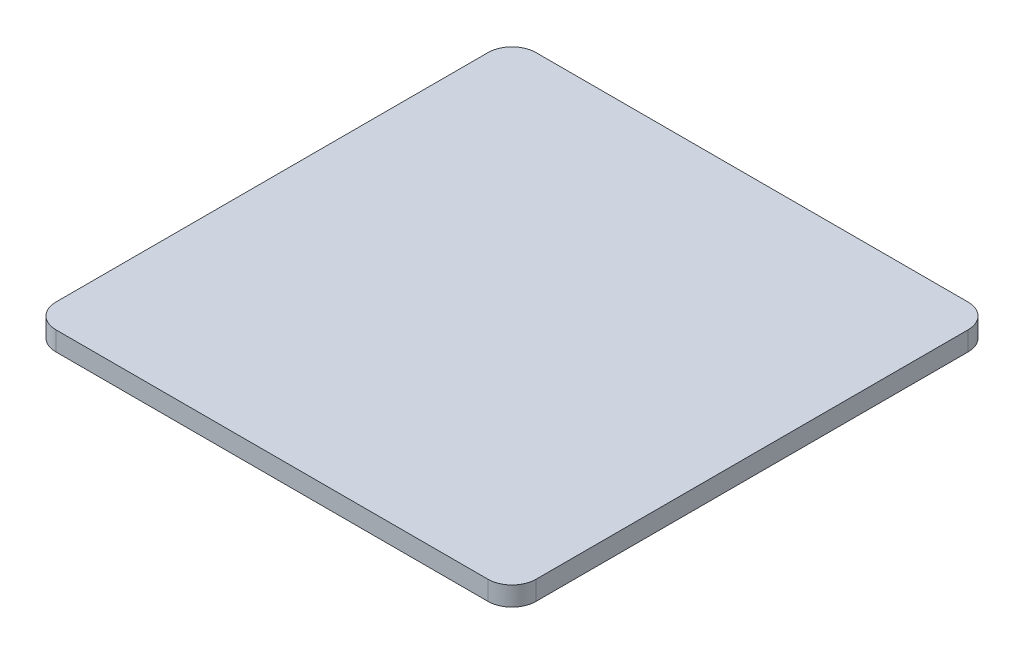
ISO-10303-21;
HEADER;
FILE_DESCRIPTION(('STEP AP214'),'2;1');
FILE_NAME('part.step','',(''),(''),'','','');
FILE_SCHEMA(('AUTOMOTIVE_DESIGN { 1 0 10303 214 1 1 1 1 }'));
ENDSEC;
DATA;
#1=APPLICATION_CONTEXT('core data for automotive mechanical design processes');
#2=APPLICATION_PROTOCOL_DEFINITION('international standard','automotive_design',2000,#1);
#3=PRODUCT_CONTEXT('',#1,'mechanical');
#4=PRODUCT('Part','Part','',(#3));
#5=PRODUCT_RELATED_PRODUCT_CATEGORY('part','',(#4));
#6=PRODUCT_DEFINITION_FORMATION('','',#4);
#7=PRODUCT_DEFINITION_CONTEXT('part definition',#1,'design');
#8=PRODUCT_DEFINITION('design','',#6,#7);
#9=PRODUCT_DEFINITION_SHAPE('','',#8);
#10=(LENGTH_UNIT() NAMED_UNIT(*) SI_UNIT(.MILLI.,.METRE.));
#11=(NAMED_UNIT(*) PLANE_ANGLE_UNIT() SI_UNIT($,.RADIAN.));
#12=(NAMED_UNIT(*) SI_UNIT($,.STERADIAN.) SOLID_ANGLE_UNIT());
#13=UNCERTAINTY_MEASURE_WITH_UNIT(LENGTH_MEASURE(1.E-05),#10,'distance_accuracy_value','');
#14=(GEOMETRIC_REPRESENTATION_CONTEXT(3) GLOBAL_UNCERTAINTY_ASSIGNED_CONTEXT((#13)) GLOBAL_UNIT_ASSIGNED_CONTEXT((#10,
#11,#12)) REPRESENTATION_CONTEXT('',''));
#15=CARTESIAN_POINT('',(0.,0.,0.));
#16=DIRECTION('',(0.,0.,1.));
#17=DIRECTION('',(1.,0.,0.));
#18=AXIS2_PLACEMENT_3D('',#15,#16,#17);
#19=CARTESIAN_POINT('',(50.,4.,-50.));
#20=DIRECTION('',(-1.,0.,0.));
#21=DIRECTION('',(0.,0.,1.));
#22=AXIS2_PLACEMENT_3D('',#19,#20,#21);
#23=PLANE('',#22);
#24=DIRECTION('',(0.,0.,-1.));
#25=VECTOR('',#24,1.);
#26=CARTESIAN_POINT('',(50.,4.,-50.));
#27=LINE('',#26,#25);
#28=CARTESIAN_POINT('',(50.,4.,45.));
#29=VERTEX_POINT('',#28);
#30=CARTESIAN_POINT('',(50.,4.,-45.));
#31=VERTEX_POINT('',#30);
#32=EDGE_CURVE('E126',#29,#31,#27,.T.);
#33=ORIENTED_EDGE('',*,*,#32,.F.);
#34=DIRECTION('',(0.,-1.,0.));
#35=VECTOR('',#34,1.);
#36=CARTESIAN_POINT('',(50.,4.,45.));
#37=LINE('',#36,#35);
#38=CARTESIAN_POINT('',(50.,0.,45.));
#39=VERTEX_POINT('',#38);
#40=EDGE_CURVE('E110',#29,#39,#37,.T.);
#41=ORIENTED_EDGE('',*,*,#40,.T.);
#42=DIRECTION('',(0.,0.,-1.));
#43=VECTOR('',#42,1.);
#44=CARTESIAN_POINT('',(50.,0.,-50.));
#45=LINE('',#44,#43);
#46=CARTESIAN_POINT('',(50.,0.,-45.));
#47=VERTEX_POINT('',#46);
#48=EDGE_CURVE('E123',#39,#47,#45,.T.);
#49=ORIENTED_EDGE('',*,*,#48,.T.);
#50=DIRECTION('',(0.,-1.,0.));
#51=VECTOR('',#50,1.);
#52=CARTESIAN_POINT('',(50.,4.,-45.));
#53=LINE('',#52,#51);
#54=EDGE_CURVE('E129',#47,#31,#53,.F.);
#55=ORIENTED_EDGE('',*,*,#54,.T.);
#56=EDGE_LOOP('',(#33,#41,#49,#55));
#57=FACE_BOUND('',#56,.T.);
#58=ADVANCED_FACE('F39',(#57),#23,.F.);
#59=CARTESIAN_POINT('',(-50.,4.,-50.));
#60=DIRECTION('',(0.,0.,1.));
#61=DIRECTION('',(1.,0.,0.));
#62=AXIS2_PLACEMENT_3D('',#59,#60,#61);
#63=PLANE('',#62);
#64=DIRECTION('',(-1.,0.,0.));
#65=VECTOR('',#64,1.);
#66=CARTESIAN_POINT('',(-50.,0.,-50.));
#67=LINE('',#66,#65);
#68=CARTESIAN_POINT('',(45.,0.,-50.));
#69=VERTEX_POINT('',#68);
#70=CARTESIAN_POINT('',(-45.,0.,-50.));
#71=VERTEX_POINT('',#70);
#72=EDGE_CURVE('E135',#69,#71,#67,.T.);
#73=ORIENTED_EDGE('',*,*,#72,.T.);
#74=DIRECTION('',(0.,-1.,0.));
#75=VECTOR('',#74,1.);
#76=CARTESIAN_POINT('',(-45.,4.,-50.));
#77=LINE('',#76,#75);
#78=CARTESIAN_POINT('',(-45.,4.,-50.));
#79=VERTEX_POINT('',#78);
#80=EDGE_CURVE('E11',#71,#79,#77,.F.);
#81=ORIENTED_EDGE('',*,*,#80,.T.);
#82=DIRECTION('',(-1.,0.,0.));
#83=VECTOR('',#82,1.);
#84=CARTESIAN_POINT('',(-50.,4.,-50.));
#85=LINE('',#84,#83);
#86=CARTESIAN_POINT('',(45.,4.,-50.));
#87=VERTEX_POINT('',#86);
#88=EDGE_CURVE('E186',#87,#79,#85,.T.);
#89=ORIENTED_EDGE('',*,*,#88,.F.);
#90=DIRECTION('',(0.,-1.,0.));
#91=VECTOR('',#90,1.);
#92=CARTESIAN_POINT('',(45.,4.,-50.));
#93=LINE('',#92,#91);
#94=EDGE_CURVE('E48',#87,#69,#93,.T.);
#95=ORIENTED_EDGE('',*,*,#94,.T.);
#96=EDGE_LOOP('',(#73,#81,#89,#95));
#97=FACE_BOUND('',#96,.T.);
#98=ADVANCED_FACE('F184',(#97),#63,.F.);
#99=CARTESIAN_POINT('',(-50.,4.,-50.));
#100=DIRECTION('',(1.,0.,0.));
#101=DIRECTION('',(0.,0.,-1.));
#102=AXIS2_PLACEMENT_3D('',#99,#100,#101);
#103=PLANE('',#102);
#104=DIRECTION('',(0.,0.,1.));
#105=VECTOR('',#104,1.);
#106=CARTESIAN_POINT('',(-50.,4.,-50.));
#107=LINE('',#106,#105);
#108=CARTESIAN_POINT('',(-50.,4.,-45.));
#109=VERTEX_POINT('',#108);
#110=CARTESIAN_POINT('',(-50.,4.,45.));
#111=VERTEX_POINT('',#110);
#112=EDGE_CURVE('E194',#109,#111,#107,.T.);
#113=ORIENTED_EDGE('',*,*,#112,.F.);
#114=DIRECTION('',(0.,-1.,0.));
#115=VECTOR('',#114,1.);
#116=CARTESIAN_POINT('',(-50.,4.,-45.));
#117=LINE('',#116,#115);
#118=CARTESIAN_POINT('',(-50.,0.,-45.));
#119=VERTEX_POINT('',#118);
#120=EDGE_CURVE('E176',#109,#119,#117,.T.);
#121=ORIENTED_EDGE('',*,*,#120,.T.);
#122=DIRECTION('',(0.,0.,1.));
#123=VECTOR('',#122,1.);
#124=CARTESIAN_POINT('',(-50.,0.,-50.));
#125=LINE('',#124,#123);
#126=CARTESIAN_POINT('',(-50.,0.,45.));
#127=VERTEX_POINT('',#126);
#128=EDGE_CURVE('E139',#119,#127,#125,.T.);
#129=ORIENTED_EDGE('',*,*,#128,.T.);
#130=DIRECTION('',(0.,-1.,0.));
#131=VECTOR('',#130,1.);
#132=CARTESIAN_POINT('',(-50.,4.,45.));
#133=LINE('',#132,#131);
#134=EDGE_CURVE('E55',#127,#111,#133,.F.);
#135=ORIENTED_EDGE('',*,*,#134,.T.);
#136=EDGE_LOOP('',(#113,#121,#129,#135));
#137=FACE_BOUND('',#136,.T.);
#138=ADVANCED_FACE('F193',(#137),#103,.F.);
#139=CARTESIAN_POINT('',(-50.,4.,50.));
#140=DIRECTION('',(0.,0.,-1.));
#141=DIRECTION('',(-1.,0.,0.));
#142=AXIS2_PLACEMENT_3D('',#139,#140,#141);
#143=PLANE('',#142);
#144=DIRECTION('',(1.,0.,0.));
#145=VECTOR('',#144,1.);
#146=CARTESIAN_POINT('',(-50.,0.,50.));
#147=LINE('',#146,#145);
#148=CARTESIAN_POINT('',(-45.,0.,50.));
#149=VERTEX_POINT('',#148);
#150=CARTESIAN_POINT('',(45.,0.,50.));
#151=VERTEX_POINT('',#150);
#152=EDGE_CURVE('E147',#149,#151,#147,.T.);
#153=ORIENTED_EDGE('',*,*,#152,.T.);
#154=DIRECTION('',(0.,-1.,0.));
#155=VECTOR('',#154,1.);
#156=CARTESIAN_POINT('',(45.,4.,50.));
#157=LINE('',#156,#155);
#158=CARTESIAN_POINT('',(45.,4.,50.));
#159=VERTEX_POINT('',#158);
#160=EDGE_CURVE('E111',#151,#159,#157,.F.);
#161=ORIENTED_EDGE('',*,*,#160,.T.);
#162=DIRECTION('',(1.,0.,0.));
#163=VECTOR('',#162,1.);
#164=CARTESIAN_POINT('',(-50.,4.,50.));
#165=LINE('',#164,#163);
#166=CARTESIAN_POINT('',(-45.,4.,50.));
#167=VERTEX_POINT('',#166);
#168=EDGE_CURVE('E142',#167,#159,#165,.T.);
#169=ORIENTED_EDGE('',*,*,#168,.F.);
#170=DIRECTION('',(0.,-1.,0.));
#171=VECTOR('',#170,1.);
#172=CARTESIAN_POINT('',(-45.,4.,50.));
#173=LINE('',#172,#171);
#174=EDGE_CURVE('E117',#167,#149,#173,.T.);
#175=ORIENTED_EDGE('',*,*,#174,.T.);
#176=EDGE_LOOP('',(#153,#161,#169,#175));
#177=FACE_BOUND('',#176,.T.);
#178=ADVANCED_FACE('F228',(#177),#143,.F.);
#179=CARTESIAN_POINT('',(0.,4.,0.));
#180=DIRECTION('',(0.,1.,0.));
#181=DIRECTION('',(0.,0.,1.));
#182=AXIS2_PLACEMENT_3D('',#179,#180,#181);
#183=PLANE('',#182);
#184=ORIENTED_EDGE('',*,*,#168,.T.);
#185=CARTESIAN_POINT('',(45.,4.,45.));
#186=DIRECTION('',(0.,1.,0.));
#187=DIRECTION('',(0.,0.,1.));
#188=AXIS2_PLACEMENT_3D('',#185,#186,#187);
#189=CIRCLE('',#188,5.);
#190=EDGE_CURVE('E171',#159,#29,#189,.T.);
#191=ORIENTED_EDGE('',*,*,#190,.T.);
#192=ORIENTED_EDGE('',*,*,#32,.T.);
#193=CARTESIAN_POINT('',(45.,4.,-45.));
#194=DIRECTION('',(0.,1.,0.));
#195=DIRECTION('',(0.,0.,1.));
#196=AXIS2_PLACEMENT_3D('',#193,#194,#195);
#197=CIRCLE('',#196,5.);
#198=EDGE_CURVE('E166',#31,#87,#197,.T.);
#199=ORIENTED_EDGE('',*,*,#198,.T.);
#200=ORIENTED_EDGE('',*,*,#88,.T.);
#201=CARTESIAN_POINT('',(-45.,4.,-45.));
#202=DIRECTION('',(0.,1.,0.));
#203=DIRECTION('',(0.,0.,1.));
#204=AXIS2_PLACEMENT_3D('',#201,#202,#203);
#205=CIRCLE('',#204,5.);
#206=EDGE_CURVE('E62',#79,#109,#205,.T.);
#207=ORIENTED_EDGE('',*,*,#206,.T.);
#208=ORIENTED_EDGE('',*,*,#112,.T.);
#209=CARTESIAN_POINT('',(-45.,4.,45.));
#210=DIRECTION('',(0.,1.,0.));
#211=DIRECTION('',(0.,0.,1.));
#212=AXIS2_PLACEMENT_3D('',#209,#210,#211);
#213=CIRCLE('',#212,5.);
#214=EDGE_CURVE('E163',#111,#167,#213,.T.);
#215=ORIENTED_EDGE('',*,*,#214,.T.);
#216=EDGE_LOOP('',(#184,#191,#192,#199,#200,#207,#208,#215));
#217=FACE_BOUND('',#216,.T.);
#218=ADVANCED_FACE('F203',(#217),#183,.T.);
#219=CARTESIAN_POINT('',(0.,0.,0.));
#220=DIRECTION('',(0.,1.,0.));
#221=DIRECTION('',(0.,0.,1.));
#222=AXIS2_PLACEMENT_3D('',#219,#220,#221);
#223=PLANE('',#222);
#224=ORIENTED_EDGE('',*,*,#48,.F.);
#225=CARTESIAN_POINT('',(45.,0.,45.));
#226=DIRECTION('',(0.,1.,0.));
#227=DIRECTION('',(0.,0.,1.));
#228=AXIS2_PLACEMENT_3D('',#225,#226,#227);
#229=CIRCLE('',#228,5.);
#230=EDGE_CURVE('E106',#39,#151,#229,.F.);
#231=ORIENTED_EDGE('',*,*,#230,.T.);
#232=ORIENTED_EDGE('',*,*,#152,.F.);
#233=CARTESIAN_POINT('',(-45.,0.,45.));
#234=DIRECTION('',(0.,1.,0.));
#235=DIRECTION('',(0.,0.,1.));
#236=AXIS2_PLACEMENT_3D('',#233,#234,#235);
#237=CIRCLE('',#236,5.);
#238=EDGE_CURVE('E128',#149,#127,#237,.F.);
#239=ORIENTED_EDGE('',*,*,#238,.T.);
#240=ORIENTED_EDGE('',*,*,#128,.F.);
#241=CARTESIAN_POINT('',(-45.,0.,-45.));
#242=DIRECTION('',(0.,1.,0.));
#243=DIRECTION('',(0.,0.,1.));
#244=AXIS2_PLACEMENT_3D('',#241,#242,#243);
#245=CIRCLE('',#244,5.);
#246=EDGE_CURVE('E118',#119,#71,#245,.F.);
#247=ORIENTED_EDGE('',*,*,#246,.T.);
#248=ORIENTED_EDGE('',*,*,#72,.F.);
#249=CARTESIAN_POINT('',(45.,0.,-45.));
#250=DIRECTION('',(0.,1.,0.));
#251=DIRECTION('',(0.,0.,1.));
#252=AXIS2_PLACEMENT_3D('',#249,#250,#251);
#253=CIRCLE('',#252,5.);
#254=EDGE_CURVE('E133',#69,#47,#253,.F.);
#255=ORIENTED_EDGE('',*,*,#254,.T.);
#256=EDGE_LOOP('',(#224,#231,#232,#239,#240,#247,#248,#255));
#257=FACE_BOUND('',#256,.T.);
#258=ADVANCED_FACE('F131',(#257),#223,.F.);
#259=CARTESIAN_POINT('',(45.,4.,45.));
#260=DIRECTION('',(0.,-1.,0.));
#261=DIRECTION('',(0.,0.,-1.));
#262=AXIS2_PLACEMENT_3D('',#259,#260,#261);
#263=CYLINDRICAL_SURFACE('',#262,5.);
#264=ORIENTED_EDGE('',*,*,#190,.F.);
#265=ORIENTED_EDGE('',*,*,#160,.F.);
#266=ORIENTED_EDGE('',*,*,#230,.F.);
#267=ORIENTED_EDGE('',*,*,#40,.F.);
#268=EDGE_LOOP('',(#264,#265,#266,#267));
#269=FACE_BOUND('',#268,.T.);
#270=ADVANCED_FACE('F109',(#269),#263,.T.);
#271=CARTESIAN_POINT('',(-45.,4.,-45.));
#272=DIRECTION('',(0.,-1.,0.));
#273=DIRECTION('',(0.,0.,-1.));
#274=AXIS2_PLACEMENT_3D('',#271,#272,#273);
#275=CYLINDRICAL_SURFACE('',#274,5.);
#276=ORIENTED_EDGE('',*,*,#206,.F.);
#277=ORIENTED_EDGE('',*,*,#80,.F.);
#278=ORIENTED_EDGE('',*,*,#246,.F.);
#279=ORIENTED_EDGE('',*,*,#120,.F.);
#280=EDGE_LOOP('',(#276,#277,#278,#279));
#281=FACE_BOUND('',#280,.T.);
#282=ADVANCED_FACE('F192',(#281),#275,.T.);
#283=CARTESIAN_POINT('',(45.,4.,-45.));
#284=DIRECTION('',(0.,-1.,0.));
#285=DIRECTION('',(0.,0.,-1.));
#286=AXIS2_PLACEMENT_3D('',#283,#284,#285);
#287=CYLINDRICAL_SURFACE('',#286,5.);
#288=ORIENTED_EDGE('',*,*,#198,.F.);
#289=ORIENTED_EDGE('',*,*,#54,.F.);
#290=ORIENTED_EDGE('',*,*,#254,.F.);
#291=ORIENTED_EDGE('',*,*,#94,.F.);
#292=EDGE_LOOP('',(#288,#289,#290,#291));
#293=FACE_BOUND('',#292,.T.);
#294=ADVANCED_FACE('F204',(#293),#287,.T.);
#295=CARTESIAN_POINT('',(-45.,4.,45.));
#296=DIRECTION('',(0.,-1.,0.));
#297=DIRECTION('',(0.,0.,-1.));
#298=AXIS2_PLACEMENT_3D('',#295,#296,#297);
#299=CYLINDRICAL_SURFACE('',#298,5.);
#300=ORIENTED_EDGE('',*,*,#214,.F.);
#301=ORIENTED_EDGE('',*,*,#134,.F.);
#302=ORIENTED_EDGE('',*,*,#238,.F.);
#303=ORIENTED_EDGE('',*,*,#174,.F.);
#304=EDGE_LOOP('',(#300,#301,#302,#303));
#305=FACE_BOUND('',#304,.T.);
#306=ADVANCED_FACE('F41',(#305),#299,.T.);
#307=CLOSED_SHELL('',(#58,#98,#138,#178,#218,#258,#270,#282,#294,#306));
#308=MANIFOLD_SOLID_BREP('B2',#307);
#309=ADVANCED_BREP_SHAPE_REPRESENTATION('',(#18,#308),#14);
#310=SHAPE_DEFINITION_REPRESENTATION(#9,#309);
ENDSEC;
END-ISO-10303-21;
